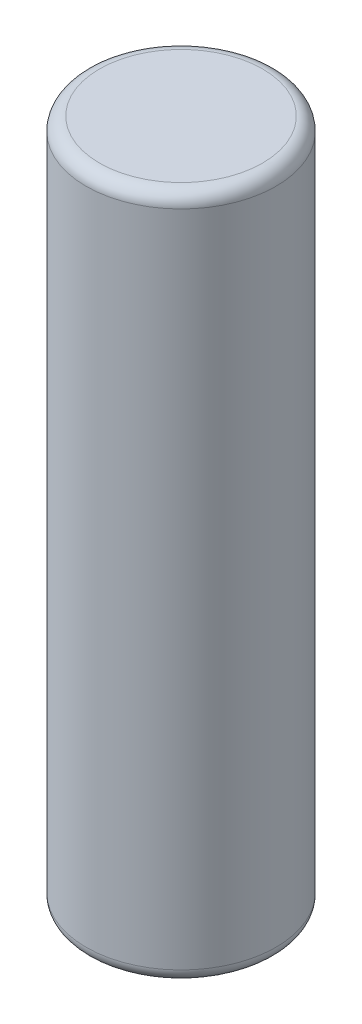
ISO-10303-21;
HEADER;
FILE_DESCRIPTION(('STEP AP214'),'2;1');
FILE_NAME('part.step','',(''),(''),'','','');
FILE_SCHEMA(('AUTOMOTIVE_DESIGN { 1 0 10303 214 1 1 1 1 }'));
ENDSEC;
DATA;
#1=APPLICATION_CONTEXT('core data for automotive mechanical design processes');
#2=APPLICATION_PROTOCOL_DEFINITION('international standard','automotive_design',2000,#1);
#3=PRODUCT_CONTEXT('',#1,'mechanical');
#4=PRODUCT('Part','Part','',(#3));
#5=PRODUCT_RELATED_PRODUCT_CATEGORY('part','',(#4));
#6=PRODUCT_DEFINITION_FORMATION('','',#4);
#7=PRODUCT_DEFINITION_CONTEXT('part definition',#1,'design');
#8=PRODUCT_DEFINITION('design','',#6,#7);
#9=PRODUCT_DEFINITION_SHAPE('','',#8);
#10=(LENGTH_UNIT() NAMED_UNIT(*) SI_UNIT(.MILLI.,.METRE.));
#11=(NAMED_UNIT(*) PLANE_ANGLE_UNIT() SI_UNIT($,.RADIAN.));
#12=(NAMED_UNIT(*) SI_UNIT($,.STERADIAN.) SOLID_ANGLE_UNIT());
#13=UNCERTAINTY_MEASURE_WITH_UNIT(LENGTH_MEASURE(1.E-05),#10,'distance_accuracy_value','');
#14=(GEOMETRIC_REPRESENTATION_CONTEXT(3) GLOBAL_UNCERTAINTY_ASSIGNED_CONTEXT((#13)) GLOBAL_UNIT_ASSIGNED_CONTEXT((#10,
#11,#12)) REPRESENTATION_CONTEXT('',''));
#15=CARTESIAN_POINT('',(0.,0.,0.));
#16=DIRECTION('',(0.,0.,1.));
#17=DIRECTION('',(1.,0.,0.));
#18=AXIS2_PLACEMENT_3D('',#15,#16,#17);
#19=CARTESIAN_POINT('',(5.68989300120393E-13,65.,-3.33066907387547E-13));
#20=DIRECTION('',(0.,-1.,0.));
#21=DIRECTION('',(0.,0.,-0.999999999999995));
#22=AXIS2_PLACEMENT_3D('',#19,#20,#21);
#23=CYLINDRICAL_SURFACE('',#22,9.);
#24=CARTESIAN_POINT('',(0.,1.26999999999999,3.88578058618805E-13));
#25=DIRECTION('',(0.,1.,0.));
#26=DIRECTION('',(0.,0.,0.999999999999995));
#27=AXIS2_PLACEMENT_3D('',#24,#25,#26);
#28=CIRCLE('',#27,9.);
#29=CARTESIAN_POINT('',(0.,1.26999999999999,9.00000000000034));
#30=VERTEX_POINT('',#29);
#31=EDGE_CURVE('E58',#30,#30,#28,.T.);
#32=ORIENTED_EDGE('',*,*,#31,.T.);
#33=EDGE_LOOP('',(#32));
#34=FACE_BOUND('',#33,.T.);
#35=CARTESIAN_POINT('',(6.38378239159465E-13,63.73,-3.33066907387547E-13));
#36=DIRECTION('',(0.,1.,0.));
#37=DIRECTION('',(0.,0.,0.999999999999995));
#38=AXIS2_PLACEMENT_3D('',#35,#36,#37);
#39=CIRCLE('',#38,9.);
#40=CARTESIAN_POINT('',(6.14897022188643E-13,63.73,8.99999999999962));
#41=VERTEX_POINT('',#40);
#42=EDGE_CURVE('E62',#41,#41,#39,.F.);
#43=ORIENTED_EDGE('',*,*,#42,.T.);
#44=EDGE_LOOP('',(#43));
#45=FACE_BOUND('',#44,.T.);
#46=ADVANCED_FACE('F47',(#34,#45),#23,.T.);
#47=CARTESIAN_POINT('',(5.68989300120393E-13,65.,-3.33066907387547E-13));
#48=DIRECTION('',(0.,1.,0.));
#49=DIRECTION('',(0.,0.,0.999999999999995));
#50=AXIS2_PLACEMENT_3D('',#47,#48,#49);
#51=PLANE('',#50);
#52=CARTESIAN_POINT('',(5.68989300120393E-13,65.,-3.33066907387547E-13));
#53=DIRECTION('',(0.,1.,0.));
#54=DIRECTION('',(0.,0.,0.999999999999995));
#55=AXIS2_PLACEMENT_3D('',#52,#53,#54);
#56=CIRCLE('',#55,7.73);
#57=CARTESIAN_POINT('',(5.48821543766564E-13,65.,7.72999999999963));
#58=VERTEX_POINT('',#57);
#59=EDGE_CURVE('E10',#58,#58,#56,.T.);
#60=ORIENTED_EDGE('',*,*,#59,.T.);
#61=EDGE_LOOP('',(#60));
#62=FACE_BOUND('',#61,.T.);
#63=ADVANCED_FACE('F78',(#62),#51,.T.);
#64=CARTESIAN_POINT('',(0.,0.,0.));
#65=DIRECTION('',(0.,1.,0.));
#66=DIRECTION('',(0.,0.,0.999999999999995));
#67=AXIS2_PLACEMENT_3D('',#64,#65,#66);
#68=PLANE('',#67);
#69=CARTESIAN_POINT('',(0.,0.,0.));
#70=DIRECTION('',(0.,1.,0.));
#71=DIRECTION('',(0.,0.,0.999999999999995));
#72=AXIS2_PLACEMENT_3D('',#69,#70,#71);
#73=CIRCLE('',#72,7.73);
#74=CARTESIAN_POINT('',(0.,0.,7.72999999999996));
#75=VERTEX_POINT('',#74);
#76=EDGE_CURVE('E54',#75,#75,#73,.F.);
#77=ORIENTED_EDGE('',*,*,#76,.T.);
#78=EDGE_LOOP('',(#77));
#79=FACE_BOUND('',#78,.T.);
#80=ADVANCED_FACE('F75',(#79),#68,.F.);
#81=CARTESIAN_POINT('',(0.,1.26999999999999,3.88578058618805E-13));
#82=DIRECTION('',(0.,1.,0.));
#83=DIRECTION('',(0.,0.,0.999999999999995));
#84=AXIS2_PLACEMENT_3D('',#81,#82,#83);
#85=TOROIDAL_SURFACE('',#84,7.73,1.27);
#86=ORIENTED_EDGE('',*,*,#76,.F.);
#87=EDGE_LOOP('',(#86));
#88=FACE_BOUND('',#87,.T.);
#89=ORIENTED_EDGE('',*,*,#31,.F.);
#90=EDGE_LOOP('',(#89));
#91=FACE_BOUND('',#90,.T.);
#92=ADVANCED_FACE('F71',(#88,#91),#85,.T.);
#93=CARTESIAN_POINT('',(6.38378239159465E-13,63.73,-3.33066907387547E-13));
#94=DIRECTION('',(0.,1.,0.));
#95=DIRECTION('',(0.,0.,0.999999999999995));
#96=AXIS2_PLACEMENT_3D('',#93,#94,#95);
#97=TOROIDAL_SURFACE('',#96,7.73,1.27);
#98=ORIENTED_EDGE('',*,*,#42,.F.);
#99=EDGE_LOOP('',(#98));
#100=FACE_BOUND('',#99,.T.);
#101=ORIENTED_EDGE('',*,*,#59,.F.);
#102=EDGE_LOOP('',(#101));
#103=FACE_BOUND('',#102,.T.);
#104=ADVANCED_FACE('F49',(#100,#103),#97,.T.);
#105=CLOSED_SHELL('',(#46,#63,#80,#92,#104));
#106=MANIFOLD_SOLID_BREP('B2',#105);
#107=ADVANCED_BREP_SHAPE_REPRESENTATION('',(#18,#106),#14);
#108=SHAPE_DEFINITION_REPRESENTATION(#9,#107);
ENDSEC;
END-ISO-10303-21;
